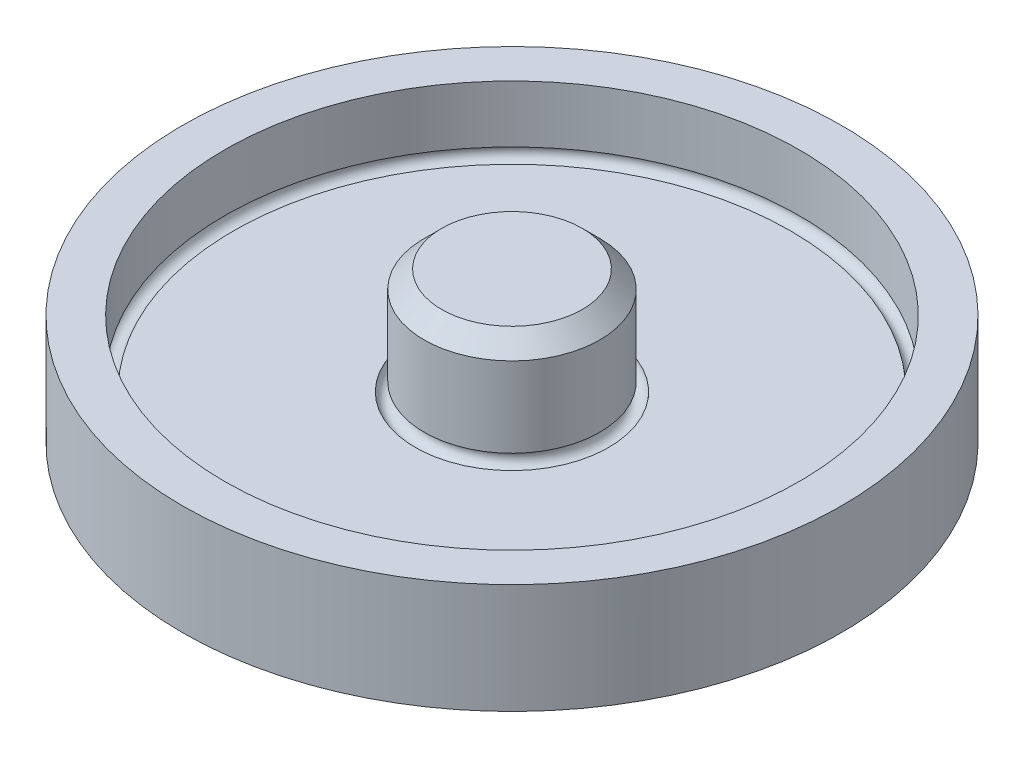
ISO-10303-21;
HEADER;
FILE_DESCRIPTION(('STEP AP214'),'2;1');
FILE_NAME('part.step','',(''),(''),'','','');
FILE_SCHEMA(('AUTOMOTIVE_DESIGN { 1 0 10303 214 1 1 1 1 }'));
ENDSEC;
DATA;
#1=APPLICATION_CONTEXT('core data for automotive mechanical design processes');
#2=APPLICATION_PROTOCOL_DEFINITION('international standard','automotive_design',2000,#1);
#3=PRODUCT_CONTEXT('',#1,'mechanical');
#4=PRODUCT('Part','Part','',(#3));
#5=PRODUCT_RELATED_PRODUCT_CATEGORY('part','',(#4));
#6=PRODUCT_DEFINITION_FORMATION('','',#4);
#7=PRODUCT_DEFINITION_CONTEXT('part definition',#1,'design');
#8=PRODUCT_DEFINITION('design','',#6,#7);
#9=PRODUCT_DEFINITION_SHAPE('','',#8);
#10=(LENGTH_UNIT() NAMED_UNIT(*) SI_UNIT(.MILLI.,.METRE.));
#11=(NAMED_UNIT(*) PLANE_ANGLE_UNIT() SI_UNIT($,.RADIAN.));
#12=(NAMED_UNIT(*) SI_UNIT($,.STERADIAN.) SOLID_ANGLE_UNIT());
#13=UNCERTAINTY_MEASURE_WITH_UNIT(LENGTH_MEASURE(1.E-05),#10,'distance_accuracy_value','');
#14=(GEOMETRIC_REPRESENTATION_CONTEXT(3) GLOBAL_UNCERTAINTY_ASSIGNED_CONTEXT((#13)) GLOBAL_UNIT_ASSIGNED_CONTEXT((#10,
#11,#12)) REPRESENTATION_CONTEXT('',''));
#15=CARTESIAN_POINT('',(0.,0.,0.));
#16=DIRECTION('',(0.,0.,1.));
#17=DIRECTION('',(1.,0.,0.));
#18=AXIS2_PLACEMENT_3D('',#15,#16,#17);
#19=CARTESIAN_POINT('',(0.,-20.955,0.));
#20=DIRECTION('',(0.,1.,0.));
#21=DIRECTION('',(0.,0.,1.));
#22=AXIS2_PLACEMENT_3D('',#19,#20,#21);
#23=CYLINDRICAL_SURFACE('',#22,23.8125);
#24=CARTESIAN_POINT('',(0.,-20.955,0.));
#25=DIRECTION('',(0.,-1.,0.));
#26=DIRECTION('',(0.,0.,-1.));
#27=AXIS2_PLACEMENT_3D('',#24,#25,#26);
#28=CIRCLE('',#27,23.8125);
#29=CARTESIAN_POINT('',(0.,-20.955,-23.8125));
#30=VERTEX_POINT('',#29);
#31=EDGE_CURVE('E89',#30,#30,#28,.T.);
#32=ORIENTED_EDGE('',*,*,#31,.F.);
#33=EDGE_LOOP('',(#32));
#34=FACE_BOUND('',#33,.T.);
#35=CARTESIAN_POINT('',(0.,-13.0175,0.));
#36=DIRECTION('',(0.,1.,0.));
#37=DIRECTION('',(0.,0.,1.));
#38=AXIS2_PLACEMENT_3D('',#35,#36,#37);
#39=CIRCLE('',#38,23.8125);
#40=CARTESIAN_POINT('',(0.,-13.0175,23.8125));
#41=VERTEX_POINT('',#40);
#42=EDGE_CURVE('E86',#41,#41,#39,.T.);
#43=ORIENTED_EDGE('',*,*,#42,.F.);
#44=EDGE_LOOP('',(#43));
#45=FACE_BOUND('',#44,.T.);
#46=ADVANCED_FACE('F45',(#34,#45),#23,.T.);
#47=CARTESIAN_POINT('',(0.,-20.955,0.));
#48=DIRECTION('',(0.,-1.,0.));
#49=DIRECTION('',(0.,0.,-1.));
#50=AXIS2_PLACEMENT_3D('',#47,#48,#49);
#51=PLANE('',#50);
#52=ORIENTED_EDGE('',*,*,#31,.T.);
#53=EDGE_LOOP('',(#52));
#54=FACE_BOUND('',#53,.T.);
#55=ADVANCED_FACE('F110',(#54),#51,.T.);
#56=CARTESIAN_POINT('',(0.,-13.0175,0.));
#57=DIRECTION('',(0.,1.,0.));
#58=DIRECTION('',(0.,0.,1.));
#59=AXIS2_PLACEMENT_3D('',#56,#57,#58);
#60=PLANE('',#59);
#61=ORIENTED_EDGE('',*,*,#42,.T.);
#62=EDGE_LOOP('',(#61));
#63=FACE_BOUND('',#62,.T.);
#64=CARTESIAN_POINT('',(0.,-13.0175,0.));
#65=DIRECTION('',(0.,1.,0.));
#66=DIRECTION('',(0.,0.,1.));
#67=AXIS2_PLACEMENT_3D('',#64,#65,#66);
#68=CIRCLE('',#67,20.7645);
#69=CARTESIAN_POINT('',(0.,-13.0175,20.7645));
#70=VERTEX_POINT('',#69);
#71=EDGE_CURVE('E79',#70,#70,#68,.T.);
#72=ORIENTED_EDGE('',*,*,#71,.F.);
#73=EDGE_LOOP('',(#72));
#74=FACE_BOUND('',#73,.T.);
#75=ADVANCED_FACE('F115',(#63,#74),#60,.T.);
#76=CARTESIAN_POINT('',(0.,-13.0175,0.));
#77=DIRECTION('',(0.,-1.,0.));
#78=DIRECTION('',(0.,0.,-1.));
#79=AXIS2_PLACEMENT_3D('',#76,#77,#78);
#80=CYLINDRICAL_SURFACE('',#79,20.7645);
#81=CARTESIAN_POINT('',(0.,-17.145,0.));
#82=DIRECTION('',(0.,-1.,0.));
#83=DIRECTION('',(0.,0.,-1.));
#84=AXIS2_PLACEMENT_3D('',#81,#82,#83);
#85=CIRCLE('',#84,20.7645);
#86=CARTESIAN_POINT('',(0.,-17.145,20.7645));
#87=VERTEX_POINT('',#86);
#88=EDGE_CURVE('E76',#87,#87,#85,.F.);
#89=ORIENTED_EDGE('',*,*,#88,.F.);
#90=EDGE_LOOP('',(#89));
#91=FACE_BOUND('',#90,.T.);
#92=ORIENTED_EDGE('',*,*,#71,.T.);
#93=EDGE_LOOP('',(#92));
#94=FACE_BOUND('',#93,.T.);
#95=ADVANCED_FACE('F128',(#91,#94),#80,.F.);
#96=CARTESIAN_POINT('',(0.,-17.78,0.));
#97=DIRECTION('',(0.,1.,0.));
#98=DIRECTION('',(0.,0.,1.));
#99=AXIS2_PLACEMENT_3D('',#96,#97,#98);
#100=TOROIDAL_SURFACE('',#99,20.7645,0.635);
#101=ORIENTED_EDGE('',*,*,#88,.T.);
#102=CARTESIAN_POINT('',(0.,-17.78,20.7645));
#103=DIRECTION('',(1.,0.,0.));
#104=DIRECTION('',(0.,0.,-1.));
#105=AXIS2_PLACEMENT_3D('',#102,#103,#104);
#106=CIRCLE('',#105,0.635);
#107=CARTESIAN_POINT('',(0.,-17.78,20.1295));
#108=VERTEX_POINT('',#107);
#109=EDGE_CURVE('E71',#87,#108,#106,.T.);
#110=ORIENTED_EDGE('',*,*,#109,.T.);
#111=CARTESIAN_POINT('',(0.,-17.78,0.));
#112=DIRECTION('',(0.,1.,0.));
#113=DIRECTION('',(0.,0.,1.));
#114=AXIS2_PLACEMENT_3D('',#111,#112,#113);
#115=CIRCLE('',#114,20.1295);
#116=EDGE_CURVE('E74',#108,#108,#115,.T.);
#117=ORIENTED_EDGE('',*,*,#116,.F.);
#118=ORIENTED_EDGE('',*,*,#109,.F.);
#119=EDGE_LOOP('',(#101,#110,#117,#118));
#120=FACE_BOUND('',#119,.T.);
#121=ADVANCED_FACE('F72',(#120),#100,.F.);
#122=CARTESIAN_POINT('',(0.,-17.78,0.));
#123=DIRECTION('',(0.,-1.,0.));
#124=DIRECTION('',(0.,0.,-1.));
#125=AXIS2_PLACEMENT_3D('',#122,#123,#124);
#126=PLANE('',#125);
#127=CARTESIAN_POINT('',(0.,-17.78,0.));
#128=DIRECTION('',(0.,-1.,0.));
#129=DIRECTION('',(0.,0.,-1.));
#130=AXIS2_PLACEMENT_3D('',#127,#128,#129);
#131=CIRCLE('',#130,6.985);
#132=CARTESIAN_POINT('',(0.,-17.78,-6.985));
#133=VERTEX_POINT('',#132);
#134=EDGE_CURVE('E93',#133,#133,#131,.T.);
#135=ORIENTED_EDGE('',*,*,#134,.T.);
#136=EDGE_LOOP('',(#135));
#137=FACE_BOUND('',#136,.T.);
#138=ORIENTED_EDGE('',*,*,#116,.T.);
#139=EDGE_LOOP('',(#138));
#140=FACE_BOUND('',#139,.T.);
#141=ADVANCED_FACE('F121',(#137,#140),#126,.F.);
#142=CARTESIAN_POINT('',(0.,-17.78,0.));
#143=DIRECTION('',(0.,-1.,0.));
#144=DIRECTION('',(0.,0.,-1.));
#145=AXIS2_PLACEMENT_3D('',#142,#143,#144);
#146=TOROIDAL_SURFACE('',#145,6.35,0.635);
#147=CARTESIAN_POINT('',(0.,-17.145,0.));
#148=DIRECTION('',(0.,-1.,0.));
#149=DIRECTION('',(0.,0.,-1.));
#150=AXIS2_PLACEMENT_3D('',#147,#148,#149);
#151=CIRCLE('',#150,6.35);
#152=CARTESIAN_POINT('',(0.,-17.145,-6.35));
#153=VERTEX_POINT('',#152);
#154=EDGE_CURVE('E77',#153,#153,#151,.T.);
#155=ORIENTED_EDGE('',*,*,#154,.T.);
#156=CARTESIAN_POINT('',(0.,-17.78,-6.35));
#157=DIRECTION('',(1.,0.,0.));
#158=DIRECTION('',(0.,0.,-1.));
#159=AXIS2_PLACEMENT_3D('',#156,#157,#158);
#160=CIRCLE('',#159,0.635);
#161=EDGE_CURVE('E61',#153,#133,#160,.T.);
#162=ORIENTED_EDGE('',*,*,#161,.T.);
#163=ORIENTED_EDGE('',*,*,#134,.F.);
#164=ORIENTED_EDGE('',*,*,#161,.F.);
#165=EDGE_LOOP('',(#155,#162,#163,#164));
#166=FACE_BOUND('',#165,.T.);
#167=ADVANCED_FACE('F123',(#166),#146,.F.);
#168=CARTESIAN_POINT('',(0.,-10.0965,0.));
#169=DIRECTION('',(0.,-1.,0.));
#170=DIRECTION('',(0.,0.,-1.));
#171=AXIS2_PLACEMENT_3D('',#168,#169,#170);
#172=PLANE('',#171);
#173=CARTESIAN_POINT('',(0.,-10.0965,0.));
#174=DIRECTION('',(0.,-1.,0.));
#175=DIRECTION('',(0.,0.,-1.));
#176=AXIS2_PLACEMENT_3D('',#173,#174,#175);
#177=CIRCLE('',#176,5.08000000000003);
#178=CARTESIAN_POINT('',(0.,-10.0965,-5.08000000000003));
#179=VERTEX_POINT('',#178);
#180=EDGE_CURVE('E54',#179,#179,#177,.F.);
#181=ORIENTED_EDGE('',*,*,#180,.T.);
#182=EDGE_LOOP('',(#181));
#183=FACE_BOUND('',#182,.T.);
#184=ADVANCED_FACE('F98',(#183),#172,.F.);
#185=CARTESIAN_POINT('',(0.,8.11801224213831,0.));
#186=DIRECTION('',(0.,-1.,0.));
#187=DIRECTION('',(0.,0.,-1.));
#188=AXIS2_PLACEMENT_3D('',#185,#186,#187);
#189=CYLINDRICAL_SURFACE('',#188,6.35);
#190=CARTESIAN_POINT('',(0.,-11.3665,0.));
#191=DIRECTION('',(0.,-1.,0.));
#192=DIRECTION('',(0.,0.,-1.));
#193=AXIS2_PLACEMENT_3D('',#190,#191,#192);
#194=CIRCLE('',#193,6.35);
#195=CARTESIAN_POINT('',(0.,-11.3665,-6.35));
#196=VERTEX_POINT('',#195);
#197=EDGE_CURVE('E12',#196,#196,#194,.T.);
#198=ORIENTED_EDGE('',*,*,#197,.T.);
#199=EDGE_LOOP('',(#198));
#200=FACE_BOUND('',#199,.T.);
#201=ORIENTED_EDGE('',*,*,#154,.F.);
#202=EDGE_LOOP('',(#201));
#203=FACE_BOUND('',#202,.T.);
#204=ADVANCED_FACE('F101',(#200,#203),#189,.T.);
#205=CARTESIAN_POINT('',(0.,-10.0965,0.));
#206=DIRECTION('',(0.,-1.,0.));
#207=DIRECTION('',(0.,0.,-1.));
#208=AXIS2_PLACEMENT_3D('',#205,#206,#207);
#209=CONICAL_SURFACE('',#208,5.08000000000003,0.785398163397444);
#210=ORIENTED_EDGE('',*,*,#197,.F.);
#211=EDGE_LOOP('',(#210));
#212=FACE_BOUND('',#211,.T.);
#213=ORIENTED_EDGE('',*,*,#180,.F.);
#214=EDGE_LOOP('',(#213));
#215=FACE_BOUND('',#214,.T.);
#216=ADVANCED_FACE('F48',(#212,#215),#209,.T.);
#217=CLOSED_SHELL('',(#46,#55,#75,#95,#121,#141,#167,#184,#204,#216));
#218=MANIFOLD_SOLID_BREP('B2',#217);
#219=ADVANCED_BREP_SHAPE_REPRESENTATION('',(#18,#218),#14);
#220=SHAPE_DEFINITION_REPRESENTATION(#9,#219);
ENDSEC;
END-ISO-10303-21;
